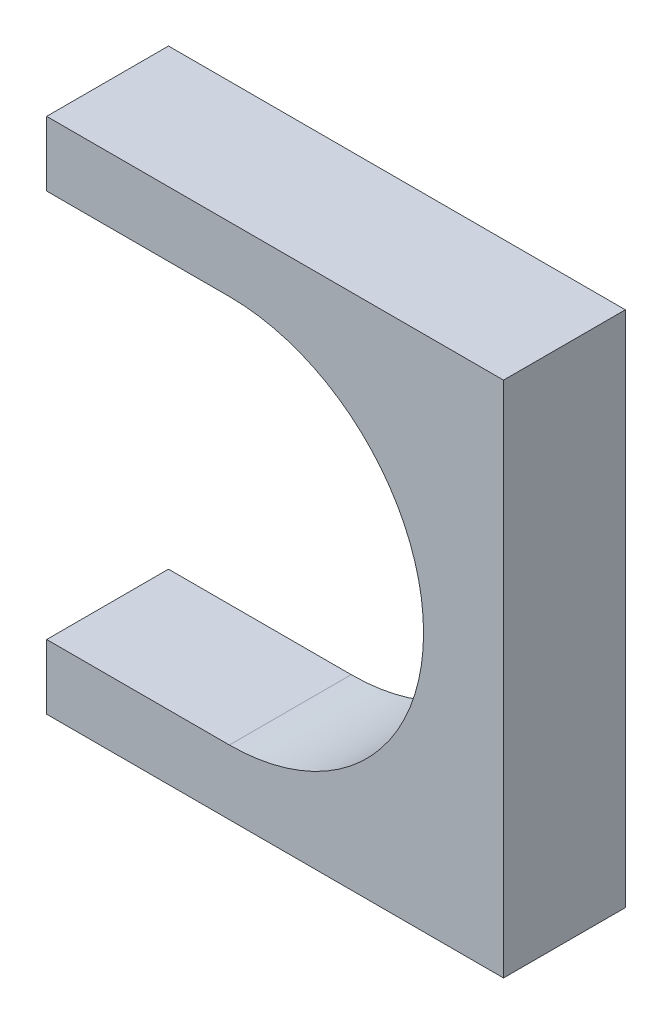
ISO-10303-21;
HEADER;
FILE_DESCRIPTION(('STEP AP214'),'2;1');
FILE_NAME('part.step','',(''),(''),'','','');
FILE_SCHEMA(('AUTOMOTIVE_DESIGN { 1 0 10303 214 1 1 1 1 }'));
ENDSEC;
DATA;
#1=APPLICATION_CONTEXT('core data for automotive mechanical design processes');
#2=APPLICATION_PROTOCOL_DEFINITION('international standard','automotive_design',2000,#1);
#3=PRODUCT_CONTEXT('',#1,'mechanical');
#4=PRODUCT('Part','Part','',(#3));
#5=PRODUCT_RELATED_PRODUCT_CATEGORY('part','',(#4));
#6=PRODUCT_DEFINITION_FORMATION('','',#4);
#7=PRODUCT_DEFINITION_CONTEXT('part definition',#1,'design');
#8=PRODUCT_DEFINITION('design','',#6,#7);
#9=PRODUCT_DEFINITION_SHAPE('','',#8);
#10=(LENGTH_UNIT() NAMED_UNIT(*) SI_UNIT(.MILLI.,.METRE.));
#11=(NAMED_UNIT(*) PLANE_ANGLE_UNIT() SI_UNIT($,.RADIAN.));
#12=(NAMED_UNIT(*) SI_UNIT($,.STERADIAN.) SOLID_ANGLE_UNIT());
#13=UNCERTAINTY_MEASURE_WITH_UNIT(LENGTH_MEASURE(1.E-05),#10,'distance_accuracy_value','');
#14=(GEOMETRIC_REPRESENTATION_CONTEXT(3) GLOBAL_UNCERTAINTY_ASSIGNED_CONTEXT((#13)) GLOBAL_UNIT_ASSIGNED_CONTEXT((#10,
#11,#12)) REPRESENTATION_CONTEXT('',''));
#15=CARTESIAN_POINT('',(0.,0.,0.));
#16=DIRECTION('',(0.,0.,1.));
#17=DIRECTION('',(1.,0.,0.));
#18=AXIS2_PLACEMENT_3D('',#15,#16,#17);
#19=CARTESIAN_POINT('',(0.,0.,8.));
#20=DIRECTION('',(0.,0.,1.));
#21=DIRECTION('',(1.,0.,0.));
#22=AXIS2_PLACEMENT_3D('',#19,#20,#21);
#23=PLANE('',#22);
#24=DIRECTION('',(1.,0.,0.));
#25=VECTOR('',#24,1.);
#26=CARTESIAN_POINT('',(0.,12.7500000000056,8.));
#27=LINE('',#26,#25);
#28=CARTESIAN_POINT('',(-12.,12.7500000000056,8.));
#29=VERTEX_POINT('',#28);
#30=CARTESIAN_POINT('',(0.,12.7500000000056,8.));
#31=VERTEX_POINT('',#30);
#32=EDGE_CURVE('E100',#29,#31,#27,.T.);
#33=ORIENTED_EDGE('',*,*,#32,.T.);
#34=CARTESIAN_POINT('',(0.,0.,8.));
#35=DIRECTION('',(0.,0.,1.));
#36=DIRECTION('',(1.,0.,0.));
#37=AXIS2_PLACEMENT_3D('',#34,#35,#36);
#38=CIRCLE('',#37,12.75);
#39=CARTESIAN_POINT('',(0.,-12.75,8.));
#40=VERTEX_POINT('',#39);
#41=EDGE_CURVE('E112',#40,#31,#38,.T.);
#42=ORIENTED_EDGE('',*,*,#41,.F.);
#43=DIRECTION('',(-1.,0.,0.));
#44=VECTOR('',#43,1.);
#45=CARTESIAN_POINT('',(0.,-12.75,8.));
#46=LINE('',#45,#44);
#47=CARTESIAN_POINT('',(-12.,-12.75,8.));
#48=VERTEX_POINT('',#47);
#49=EDGE_CURVE('E50',#40,#48,#46,.T.);
#50=ORIENTED_EDGE('',*,*,#49,.T.);
#51=DIRECTION('',(0.,-1.,0.));
#52=VECTOR('',#51,1.);
#53=CARTESIAN_POINT('',(-12.,17.,8.));
#54=LINE('',#53,#52);
#55=CARTESIAN_POINT('',(-12.,-17.,8.));
#56=VERTEX_POINT('',#55);
#57=EDGE_CURVE('E140',#48,#56,#54,.T.);
#58=ORIENTED_EDGE('',*,*,#57,.T.);
#59=DIRECTION('',(1.,0.,0.));
#60=VECTOR('',#59,1.);
#61=CARTESIAN_POINT('',(18.,-17.,8.));
#62=LINE('',#61,#60);
#63=CARTESIAN_POINT('',(18.,-17.,8.));
#64=VERTEX_POINT('',#63);
#65=EDGE_CURVE('E128',#56,#64,#62,.T.);
#66=ORIENTED_EDGE('',*,*,#65,.T.);
#67=DIRECTION('',(0.,1.,0.));
#68=VECTOR('',#67,1.);
#69=CARTESIAN_POINT('',(18.,17.,8.));
#70=LINE('',#69,#68);
#71=CARTESIAN_POINT('',(18.,17.,8.));
#72=VERTEX_POINT('',#71);
#73=EDGE_CURVE('E120',#64,#72,#70,.T.);
#74=ORIENTED_EDGE('',*,*,#73,.T.);
#75=DIRECTION('',(-1.,0.,0.));
#76=VECTOR('',#75,1.);
#77=CARTESIAN_POINT('',(18.,17.,8.));
#78=LINE('',#77,#76);
#79=CARTESIAN_POINT('',(-12.,17.,8.));
#80=VERTEX_POINT('',#79);
#81=EDGE_CURVE('E138',#72,#80,#78,.T.);
#82=ORIENTED_EDGE('',*,*,#81,.T.);
#83=EDGE_CURVE('E114',#80,#29,#54,.T.);
#84=ORIENTED_EDGE('',*,*,#83,.T.);
#85=EDGE_LOOP('',(#33,#42,#50,#58,#66,#74,#82,#84));
#86=FACE_BOUND('',#85,.T.);
#87=ADVANCED_FACE('F33',(#86),#23,.T.);
#88=CARTESIAN_POINT('',(0.,0.,0.));
#89=DIRECTION('',(0.,0.,1.));
#90=DIRECTION('',(1.,0.,0.));
#91=AXIS2_PLACEMENT_3D('',#88,#89,#90);
#92=PLANE('',#91);
#93=CARTESIAN_POINT('',(0.,0.,0.));
#94=DIRECTION('',(0.,0.,1.));
#95=DIRECTION('',(1.,0.,0.));
#96=AXIS2_PLACEMENT_3D('',#93,#94,#95);
#97=CIRCLE('',#96,12.75);
#98=CARTESIAN_POINT('',(0.,-12.75,0.));
#99=VERTEX_POINT('',#98);
#100=CARTESIAN_POINT('',(0.,12.75,0.));
#101=VERTEX_POINT('',#100);
#102=EDGE_CURVE('E117',#99,#101,#97,.T.);
#103=ORIENTED_EDGE('',*,*,#102,.T.);
#104=DIRECTION('',(1.,0.,0.));
#105=VECTOR('',#104,1.);
#106=CARTESIAN_POINT('',(0.,12.7500000000056,0.));
#107=LINE('',#106,#105);
#108=CARTESIAN_POINT('',(-12.,12.7500000000056,0.));
#109=VERTEX_POINT('',#108);
#110=EDGE_CURVE('E58',#109,#101,#107,.T.);
#111=ORIENTED_EDGE('',*,*,#110,.F.);
#112=DIRECTION('',(0.,-1.,0.));
#113=VECTOR('',#112,1.);
#114=CARTESIAN_POINT('',(-12.,17.,0.));
#115=LINE('',#114,#113);
#116=CARTESIAN_POINT('',(-12.,17.,0.));
#117=VERTEX_POINT('',#116);
#118=EDGE_CURVE('E131',#117,#109,#115,.T.);
#119=ORIENTED_EDGE('',*,*,#118,.F.);
#120=DIRECTION('',(-1.,0.,0.));
#121=VECTOR('',#120,1.);
#122=CARTESIAN_POINT('',(18.,17.,0.));
#123=LINE('',#122,#121);
#124=CARTESIAN_POINT('',(18.,17.,0.));
#125=VERTEX_POINT('',#124);
#126=EDGE_CURVE('E127',#125,#117,#123,.T.);
#127=ORIENTED_EDGE('',*,*,#126,.F.);
#128=DIRECTION('',(0.,1.,0.));
#129=VECTOR('',#128,1.);
#130=CARTESIAN_POINT('',(18.,17.,0.));
#131=LINE('',#130,#129);
#132=CARTESIAN_POINT('',(18.,-17.,0.));
#133=VERTEX_POINT('',#132);
#134=EDGE_CURVE('E124',#133,#125,#131,.T.);
#135=ORIENTED_EDGE('',*,*,#134,.F.);
#136=DIRECTION('',(1.,0.,0.));
#137=VECTOR('',#136,1.);
#138=CARTESIAN_POINT('',(18.,-17.,0.));
#139=LINE('',#138,#137);
#140=CARTESIAN_POINT('',(-12.,-17.,0.));
#141=VERTEX_POINT('',#140);
#142=EDGE_CURVE('E134',#141,#133,#139,.T.);
#143=ORIENTED_EDGE('',*,*,#142,.F.);
#144=CARTESIAN_POINT('',(-12.,-12.75,0.));
#145=VERTEX_POINT('',#144);
#146=EDGE_CURVE('E130',#145,#141,#115,.T.);
#147=ORIENTED_EDGE('',*,*,#146,.F.);
#148=DIRECTION('',(-1.,0.,0.));
#149=VECTOR('',#148,1.);
#150=CARTESIAN_POINT('',(0.,-12.75,0.));
#151=LINE('',#150,#149);
#152=EDGE_CURVE('E168',#99,#145,#151,.T.);
#153=ORIENTED_EDGE('',*,*,#152,.F.);
#154=EDGE_LOOP('',(#103,#111,#119,#127,#135,#143,#147,#153));
#155=FACE_BOUND('',#154,.T.);
#156=ADVANCED_FACE('F35',(#155),#92,.F.);
#157=CARTESIAN_POINT('',(18.,-17.,0.));
#158=DIRECTION('',(0.,-1.,0.));
#159=DIRECTION('',(1.,0.,0.));
#160=AXIS2_PLACEMENT_3D('',#157,#158,#159);
#161=PLANE('',#160);
#162=ORIENTED_EDGE('',*,*,#142,.T.);
#163=DIRECTION('',(0.,0.,1.));
#164=VECTOR('',#163,1.);
#165=CARTESIAN_POINT('',(18.,-17.,0.));
#166=LINE('',#165,#164);
#167=EDGE_CURVE('E11',#133,#64,#166,.T.);
#168=ORIENTED_EDGE('',*,*,#167,.T.);
#169=ORIENTED_EDGE('',*,*,#65,.F.);
#170=DIRECTION('',(0.,0.,1.));
#171=VECTOR('',#170,1.);
#172=CARTESIAN_POINT('',(-12.,-17.,0.));
#173=LINE('',#172,#171);
#174=EDGE_CURVE('E42',#141,#56,#173,.T.);
#175=ORIENTED_EDGE('',*,*,#174,.F.);
#176=EDGE_LOOP('',(#162,#168,#169,#175));
#177=FACE_BOUND('',#176,.T.);
#178=ADVANCED_FACE('F159',(#177),#161,.T.);
#179=CARTESIAN_POINT('',(-12.,17.,0.));
#180=DIRECTION('',(-1.,0.,0.));
#181=DIRECTION('',(0.,-1.,0.));
#182=AXIS2_PLACEMENT_3D('',#179,#180,#181);
#183=PLANE('',#182);
#184=DIRECTION('',(0.,0.,-1.));
#185=VECTOR('',#184,1.);
#186=CARTESIAN_POINT('',(-12.,12.7500000000056,0.));
#187=LINE('',#186,#185);
#188=EDGE_CURVE('E118',#29,#109,#187,.T.);
#189=ORIENTED_EDGE('',*,*,#188,.F.);
#190=ORIENTED_EDGE('',*,*,#83,.F.);
#191=DIRECTION('',(0.,0.,1.));
#192=VECTOR('',#191,1.);
#193=CARTESIAN_POINT('',(-12.,17.,0.));
#194=LINE('',#193,#192);
#195=EDGE_CURVE('E144',#117,#80,#194,.T.);
#196=ORIENTED_EDGE('',*,*,#195,.F.);
#197=ORIENTED_EDGE('',*,*,#118,.T.);
#198=EDGE_LOOP('',(#189,#190,#196,#197));
#199=FACE_BOUND('',#198,.T.);
#200=ADVANCED_FACE('F166',(#199),#183,.T.);
#201=DIRECTION('',(0.,0.,1.));
#202=VECTOR('',#201,1.);
#203=CARTESIAN_POINT('',(-12.,-12.75,0.));
#204=LINE('',#203,#202);
#205=EDGE_CURVE('E106',#145,#48,#204,.T.);
#206=ORIENTED_EDGE('',*,*,#205,.F.);
#207=ORIENTED_EDGE('',*,*,#146,.T.);
#208=ORIENTED_EDGE('',*,*,#174,.T.);
#209=ORIENTED_EDGE('',*,*,#57,.F.);
#210=EDGE_LOOP('',(#206,#207,#208,#209));
#211=FACE_BOUND('',#210,.T.);
#212=ADVANCED_FACE('F177',(#211),#183,.T.);
#213=CARTESIAN_POINT('',(18.,17.,0.));
#214=DIRECTION('',(0.,1.,0.));
#215=DIRECTION('',(-1.,0.,0.));
#216=AXIS2_PLACEMENT_3D('',#213,#214,#215);
#217=PLANE('',#216);
#218=ORIENTED_EDGE('',*,*,#126,.T.);
#219=ORIENTED_EDGE('',*,*,#195,.T.);
#220=ORIENTED_EDGE('',*,*,#81,.F.);
#221=DIRECTION('',(0.,0.,1.));
#222=VECTOR('',#221,1.);
#223=CARTESIAN_POINT('',(18.,17.,0.));
#224=LINE('',#223,#222);
#225=EDGE_CURVE('E37',#125,#72,#224,.T.);
#226=ORIENTED_EDGE('',*,*,#225,.F.);
#227=EDGE_LOOP('',(#218,#219,#220,#226));
#228=FACE_BOUND('',#227,.T.);
#229=ADVANCED_FACE('F164',(#228),#217,.T.);
#230=CARTESIAN_POINT('',(18.,17.,0.));
#231=DIRECTION('',(1.,0.,0.));
#232=DIRECTION('',(0.,0.,-1.));
#233=AXIS2_PLACEMENT_3D('',#230,#231,#232);
#234=PLANE('',#233);
#235=ORIENTED_EDGE('',*,*,#73,.F.);
#236=ORIENTED_EDGE('',*,*,#167,.F.);
#237=ORIENTED_EDGE('',*,*,#134,.T.);
#238=ORIENTED_EDGE('',*,*,#225,.T.);
#239=EDGE_LOOP('',(#235,#236,#237,#238));
#240=FACE_BOUND('',#239,.T.);
#241=ADVANCED_FACE('F151',(#240),#234,.T.);
#242=CARTESIAN_POINT('',(0.,0.,0.));
#243=DIRECTION('',(0.,0.,1.));
#244=DIRECTION('',(1.,0.,0.));
#245=AXIS2_PLACEMENT_3D('',#242,#243,#244);
#246=CYLINDRICAL_SURFACE('',#245,12.75);
#247=ORIENTED_EDGE('',*,*,#41,.T.);
#248=DIRECTION('',(0.,0.,-1.));
#249=VECTOR('',#248,1.);
#250=CARTESIAN_POINT('',(0.,12.7500000000056,8.));
#251=LINE('',#250,#249);
#252=EDGE_CURVE('E97',#31,#101,#251,.T.);
#253=ORIENTED_EDGE('',*,*,#252,.T.);
#254=ORIENTED_EDGE('',*,*,#102,.F.);
#255=DIRECTION('',(0.,0.,-1.));
#256=VECTOR('',#255,1.);
#257=CARTESIAN_POINT('',(0.,-12.75,8.));
#258=LINE('',#257,#256);
#259=EDGE_CURVE('E107',#40,#99,#258,.T.);
#260=ORIENTED_EDGE('',*,*,#259,.F.);
#261=EDGE_LOOP('',(#247,#253,#254,#260));
#262=FACE_BOUND('',#261,.T.);
#263=ADVANCED_FACE('F116',(#262),#246,.F.);
#264=CARTESIAN_POINT('',(0.,-12.75,8.));
#265=DIRECTION('',(0.,-1.,0.));
#266=DIRECTION('',(0.,0.,-1.));
#267=AXIS2_PLACEMENT_3D('',#264,#265,#266);
#268=PLANE('',#267);
#269=ORIENTED_EDGE('',*,*,#205,.T.);
#270=ORIENTED_EDGE('',*,*,#49,.F.);
#271=ORIENTED_EDGE('',*,*,#259,.T.);
#272=ORIENTED_EDGE('',*,*,#152,.T.);
#273=EDGE_LOOP('',(#269,#270,#271,#272));
#274=FACE_BOUND('',#273,.T.);
#275=ADVANCED_FACE('F175',(#274),#268,.F.);
#276=CARTESIAN_POINT('',(0.,12.7500000000056,8.));
#277=DIRECTION('',(0.,1.,0.));
#278=DIRECTION('',(0.,0.,1.));
#279=AXIS2_PLACEMENT_3D('',#276,#277,#278);
#280=PLANE('',#279);
#281=ORIENTED_EDGE('',*,*,#188,.T.);
#282=ORIENTED_EDGE('',*,*,#110,.T.);
#283=ORIENTED_EDGE('',*,*,#252,.F.);
#284=ORIENTED_EDGE('',*,*,#32,.F.);
#285=EDGE_LOOP('',(#281,#282,#283,#284));
#286=FACE_BOUND('',#285,.T.);
#287=ADVANCED_FACE('F99',(#286),#280,.F.);
#288=CLOSED_SHELL('',(#87,#156,#178,#200,#212,#229,#241,#263,#275,#287));
#289=MANIFOLD_SOLID_BREP('B2',#288);
#290=ADVANCED_BREP_SHAPE_REPRESENTATION('',(#18,#289),#14);
#291=SHAPE_DEFINITION_REPRESENTATION(#9,#290);
ENDSEC;
END-ISO-10303-21;
